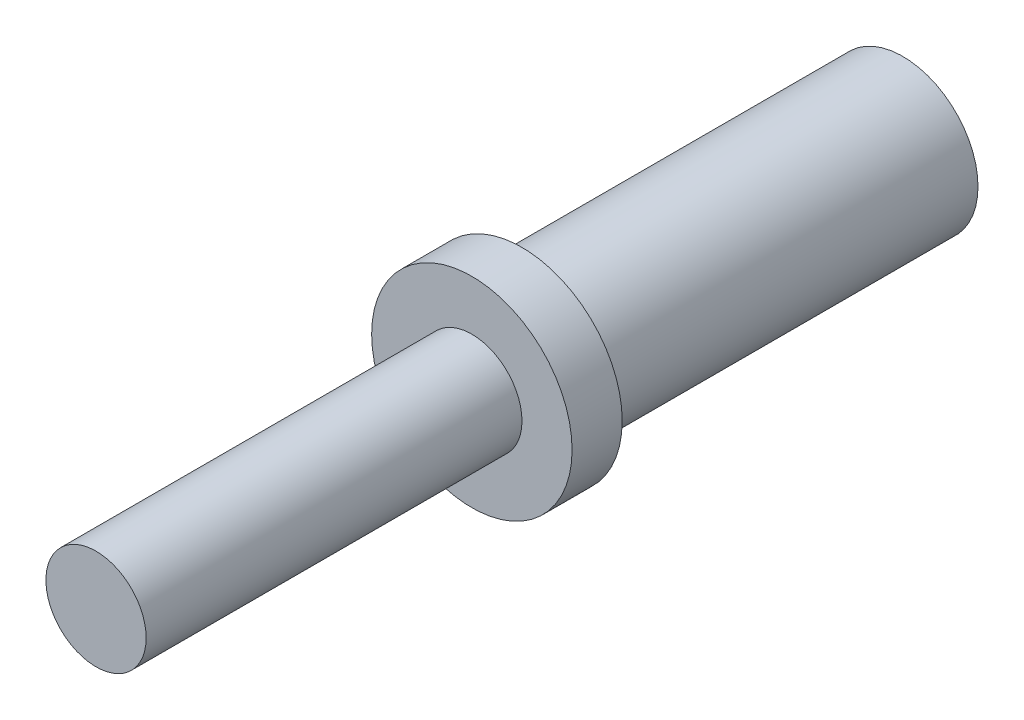
ISO-10303-21;
HEADER;
FILE_DESCRIPTION(('STEP AP214'),'2;1');
FILE_NAME('part.step','',(''),(''),'','','');
FILE_SCHEMA(('AUTOMOTIVE_DESIGN { 1 0 10303 214 1 1 1 1 }'));
ENDSEC;
DATA;
#1=APPLICATION_CONTEXT('core data for automotive mechanical design processes');
#2=APPLICATION_PROTOCOL_DEFINITION('international standard','automotive_design',2000,#1);
#3=PRODUCT_CONTEXT('',#1,'mechanical');
#4=PRODUCT('Part','Part','',(#3));
#5=PRODUCT_RELATED_PRODUCT_CATEGORY('part','',(#4));
#6=PRODUCT_DEFINITION_FORMATION('','',#4);
#7=PRODUCT_DEFINITION_CONTEXT('part definition',#1,'design');
#8=PRODUCT_DEFINITION('design','',#6,#7);
#9=PRODUCT_DEFINITION_SHAPE('','',#8);
#10=(LENGTH_UNIT() NAMED_UNIT(*) SI_UNIT(.MILLI.,.METRE.));
#11=(NAMED_UNIT(*) PLANE_ANGLE_UNIT() SI_UNIT($,.RADIAN.));
#12=(NAMED_UNIT(*) SI_UNIT($,.STERADIAN.) SOLID_ANGLE_UNIT());
#13=UNCERTAINTY_MEASURE_WITH_UNIT(LENGTH_MEASURE(1.E-05),#10,'distance_accuracy_value','');
#14=(GEOMETRIC_REPRESENTATION_CONTEXT(3) GLOBAL_UNCERTAINTY_ASSIGNED_CONTEXT((#13)) GLOBAL_UNIT_ASSIGNED_CONTEXT((#10,
#11,#12)) REPRESENTATION_CONTEXT('',''));
#15=CARTESIAN_POINT('',(0.,0.,0.));
#16=DIRECTION('',(0.,0.,1.));
#17=DIRECTION('',(1.,0.,0.));
#18=AXIS2_PLACEMENT_3D('',#15,#16,#17);
#19=CARTESIAN_POINT('',(0.,0.,0.));
#20=DIRECTION('',(0.,0.,1.));
#21=DIRECTION('',(1.,0.,0.));
#22=AXIS2_PLACEMENT_3D('',#19,#20,#21);
#23=PLANE('',#22);
#24=CARTESIAN_POINT('',(0.,0.,0.));
#25=DIRECTION('',(0.,0.,1.));
#26=DIRECTION('',(1.,0.,0.));
#27=AXIS2_PLACEMENT_3D('',#24,#25,#26);
#28=CIRCLE('',#27,2.);
#29=CARTESIAN_POINT('',(2.,0.,0.));
#30=VERTEX_POINT('',#29);
#31=EDGE_CURVE('E10',#30,#30,#28,.T.);
#32=ORIENTED_EDGE('',*,*,#31,.T.);
#33=EDGE_LOOP('',(#32));
#34=FACE_BOUND('',#33,.T.);
#35=ADVANCED_FACE('F40',(#34),#23,.T.);
#36=CARTESIAN_POINT('',(0.,0.,0.));
#37=DIRECTION('',(0.,0.,1.));
#38=DIRECTION('',(1.,0.,0.));
#39=AXIS2_PLACEMENT_3D('',#36,#37,#38);
#40=CYLINDRICAL_SURFACE('',#39,2.);
#41=CARTESIAN_POINT('',(0.,0.,-15.));
#42=DIRECTION('',(0.,0.,1.));
#43=DIRECTION('',(1.,0.,0.));
#44=AXIS2_PLACEMENT_3D('',#41,#42,#43);
#45=CIRCLE('',#44,2.);
#46=CARTESIAN_POINT('',(2.,0.,-15.));
#47=VERTEX_POINT('',#46);
#48=EDGE_CURVE('E47',#47,#47,#45,.T.);
#49=ORIENTED_EDGE('',*,*,#48,.T.);
#50=EDGE_LOOP('',(#49));
#51=FACE_BOUND('',#50,.T.);
#52=ORIENTED_EDGE('',*,*,#31,.F.);
#53=EDGE_LOOP('',(#52));
#54=FACE_BOUND('',#53,.T.);
#55=ADVANCED_FACE('F84',(#51,#54),#40,.T.);
#56=CARTESIAN_POINT('',(0.,-2.,-15.));
#57=DIRECTION('',(0.,0.,1.));
#58=DIRECTION('',(1.,0.,0.));
#59=AXIS2_PLACEMENT_3D('',#56,#57,#58);
#60=PLANE('',#59);
#61=CARTESIAN_POINT('',(0.,0.,-15.));
#62=DIRECTION('',(0.,0.,1.));
#63=DIRECTION('',(1.,0.,0.));
#64=AXIS2_PLACEMENT_3D('',#61,#62,#63);
#65=CIRCLE('',#64,4.);
#66=CARTESIAN_POINT('',(4.,0.,-15.));
#67=VERTEX_POINT('',#66);
#68=EDGE_CURVE('E52',#67,#67,#65,.T.);
#69=ORIENTED_EDGE('',*,*,#68,.T.);
#70=EDGE_LOOP('',(#69));
#71=FACE_BOUND('',#70,.T.);
#72=ORIENTED_EDGE('',*,*,#48,.F.);
#73=EDGE_LOOP('',(#72));
#74=FACE_BOUND('',#73,.T.);
#75=ADVANCED_FACE('F88',(#71,#74),#60,.T.);
#76=CARTESIAN_POINT('',(0.,0.,0.));
#77=DIRECTION('',(0.,0.,1.));
#78=DIRECTION('',(1.,0.,0.));
#79=AXIS2_PLACEMENT_3D('',#76,#77,#78);
#80=CYLINDRICAL_SURFACE('',#79,4.);
#81=CARTESIAN_POINT('',(0.,0.,-17.));
#82=DIRECTION('',(0.,0.,1.));
#83=DIRECTION('',(1.,0.,0.));
#84=AXIS2_PLACEMENT_3D('',#81,#82,#83);
#85=CIRCLE('',#84,4.);
#86=CARTESIAN_POINT('',(4.,0.,-17.));
#87=VERTEX_POINT('',#86);
#88=EDGE_CURVE('E57',#87,#87,#85,.T.);
#89=ORIENTED_EDGE('',*,*,#88,.T.);
#90=EDGE_LOOP('',(#89));
#91=FACE_BOUND('',#90,.T.);
#92=ORIENTED_EDGE('',*,*,#68,.F.);
#93=EDGE_LOOP('',(#92));
#94=FACE_BOUND('',#93,.T.);
#95=ADVANCED_FACE('F92',(#91,#94),#80,.T.);
#96=CARTESIAN_POINT('',(0.,-4.,-17.));
#97=DIRECTION('',(0.,0.,-1.));
#98=DIRECTION('',(-1.,0.,0.));
#99=AXIS2_PLACEMENT_3D('',#96,#97,#98);
#100=PLANE('',#99);
#101=CARTESIAN_POINT('',(0.,0.,-17.));
#102=DIRECTION('',(0.,0.,1.));
#103=DIRECTION('',(1.,0.,0.));
#104=AXIS2_PLACEMENT_3D('',#101,#102,#103);
#105=CIRCLE('',#104,3.);
#106=CARTESIAN_POINT('',(3.,0.,-17.));
#107=VERTEX_POINT('',#106);
#108=EDGE_CURVE('E63',#107,#107,#105,.T.);
#109=ORIENTED_EDGE('',*,*,#108,.T.);
#110=EDGE_LOOP('',(#109));
#111=FACE_BOUND('',#110,.T.);
#112=ORIENTED_EDGE('',*,*,#88,.F.);
#113=EDGE_LOOP('',(#112));
#114=FACE_BOUND('',#113,.T.);
#115=ADVANCED_FACE('F81',(#111,#114),#100,.T.);
#116=CARTESIAN_POINT('',(0.,0.,0.));
#117=DIRECTION('',(0.,0.,1.));
#118=DIRECTION('',(1.,0.,0.));
#119=AXIS2_PLACEMENT_3D('',#116,#117,#118);
#120=CYLINDRICAL_SURFACE('',#119,3.);
#121=CARTESIAN_POINT('',(0.,0.,-32.2));
#122=DIRECTION('',(0.,0.,1.));
#123=DIRECTION('',(1.,0.,0.));
#124=AXIS2_PLACEMENT_3D('',#121,#122,#123);
#125=CIRCLE('',#124,3.);
#126=CARTESIAN_POINT('',(3.,0.,-32.2));
#127=VERTEX_POINT('',#126);
#128=EDGE_CURVE('E67',#127,#127,#125,.T.);
#129=ORIENTED_EDGE('',*,*,#128,.T.);
#130=EDGE_LOOP('',(#129));
#131=FACE_BOUND('',#130,.T.);
#132=ORIENTED_EDGE('',*,*,#108,.F.);
#133=EDGE_LOOP('',(#132));
#134=FACE_BOUND('',#133,.T.);
#135=ADVANCED_FACE('F72',(#131,#134),#120,.T.);
#136=CARTESIAN_POINT('',(0.,-3.,-32.2));
#137=DIRECTION('',(0.,0.,-1.));
#138=DIRECTION('',(-1.,0.,0.));
#139=AXIS2_PLACEMENT_3D('',#136,#137,#138);
#140=PLANE('',#139);
#141=ORIENTED_EDGE('',*,*,#128,.F.);
#142=EDGE_LOOP('',(#141));
#143=FACE_BOUND('',#142,.T.);
#144=ADVANCED_FACE('F75',(#143),#140,.T.);
#145=CLOSED_SHELL('',(#35,#55,#75,#95,#115,#135,#144));
#146=MANIFOLD_SOLID_BREP('B2',#145);
#147=ADVANCED_BREP_SHAPE_REPRESENTATION('',(#18,#146),#14);
#148=SHAPE_DEFINITION_REPRESENTATION(#9,#147);
ENDSEC;
END-ISO-10303-21;
